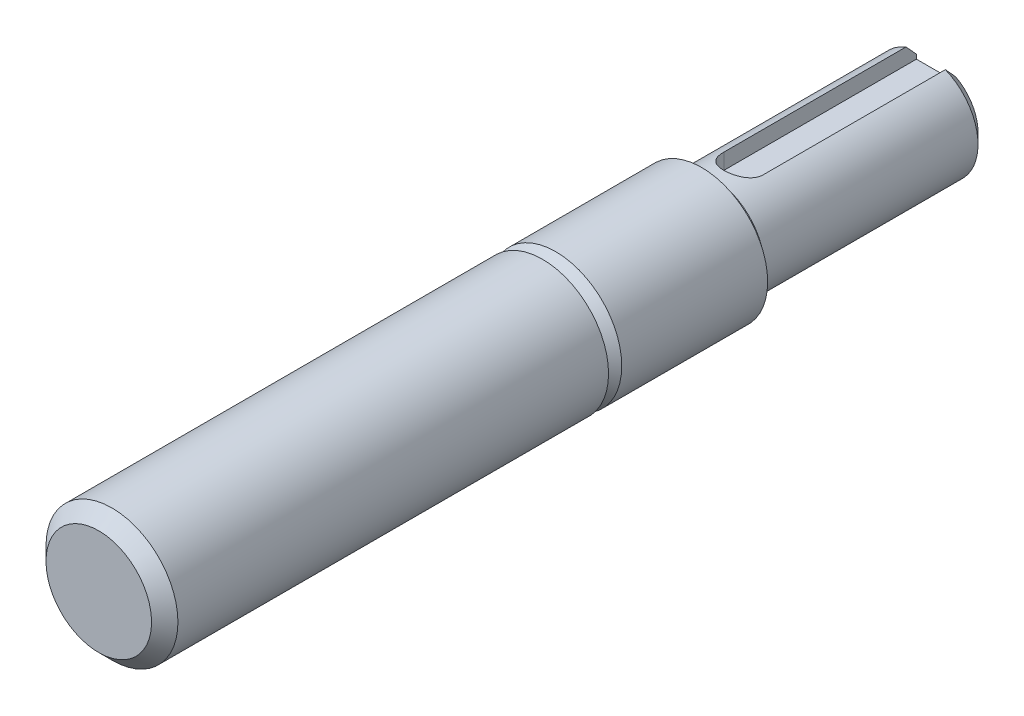
ISO-10303-21;
HEADER;
FILE_DESCRIPTION(('STEP AP214'),'2;1');
FILE_NAME('part.step','',(''),(''),'','','');
FILE_SCHEMA(('AUTOMOTIVE_DESIGN { 1 0 10303 214 1 1 1 1 }'));
ENDSEC;
DATA;
#1=APPLICATION_CONTEXT('core data for automotive mechanical design processes');
#2=APPLICATION_PROTOCOL_DEFINITION('international standard','automotive_design',2000,#1);
#3=PRODUCT_CONTEXT('',#1,'mechanical');
#4=PRODUCT('Part','Part','',(#3));
#5=PRODUCT_RELATED_PRODUCT_CATEGORY('part','',(#4));
#6=PRODUCT_DEFINITION_FORMATION('','',#4);
#7=PRODUCT_DEFINITION_CONTEXT('part definition',#1,'design');
#8=PRODUCT_DEFINITION('design','',#6,#7);
#9=PRODUCT_DEFINITION_SHAPE('','',#8);
#10=(LENGTH_UNIT() NAMED_UNIT(*) SI_UNIT(.MILLI.,.METRE.));
#11=(NAMED_UNIT(*) PLANE_ANGLE_UNIT() SI_UNIT($,.RADIAN.));
#12=(NAMED_UNIT(*) SI_UNIT($,.STERADIAN.) SOLID_ANGLE_UNIT());
#13=UNCERTAINTY_MEASURE_WITH_UNIT(LENGTH_MEASURE(1.E-05),#10,'distance_accuracy_value','');
#14=(GEOMETRIC_REPRESENTATION_CONTEXT(3) GLOBAL_UNCERTAINTY_ASSIGNED_CONTEXT((#13)) GLOBAL_UNIT_ASSIGNED_CONTEXT((#10,
#11,#12)) REPRESENTATION_CONTEXT('',''));
#15=CARTESIAN_POINT('',(0.,0.,0.));
#16=DIRECTION('',(0.,0.,1.));
#17=DIRECTION('',(1.,0.,0.));
#18=AXIS2_PLACEMENT_3D('',#15,#16,#17);
#19=CARTESIAN_POINT('',(0.,1.9812,-39.116));
#20=DIRECTION('',(0.,1.,0.));
#21=DIRECTION('',(0.,0.,1.));
#22=AXIS2_PLACEMENT_3D('',#19,#20,#21);
#23=PLANE('',#22);
#24=CARTESIAN_POINT('',(0.,1.9812,-39.116));
#25=DIRECTION('',(0.,1.,0.));
#26=DIRECTION('',(0.,0.,1.));
#27=AXIS2_PLACEMENT_3D('',#24,#25,#26);
#28=CIRCLE('',#27,1.19380000000001);
#29=CARTESIAN_POINT('',(-1.19380000000001,1.9812,-39.116));
#30=VERTEX_POINT('',#29);
#31=CARTESIAN_POINT('',(1.19380000000001,1.9812,-39.116));
#32=VERTEX_POINT('',#31);
#33=EDGE_CURVE('E75',#30,#32,#28,.T.);
#34=ORIENTED_EDGE('',*,*,#33,.T.);
#35=DIRECTION('',(0.,0.,-1.));
#36=VECTOR('',#35,1.);
#37=CARTESIAN_POINT('',(1.19380000000001,1.9812,-39.116));
#38=LINE('',#37,#36);
#39=CARTESIAN_POINT('',(1.19380000000001,1.9812,-50.8));
#40=VERTEX_POINT('',#39);
#41=EDGE_CURVE('E71',#32,#40,#38,.T.);
#42=ORIENTED_EDGE('',*,*,#41,.T.);
#43=DIRECTION('',(1.,0.,0.));
#44=VECTOR('',#43,1.);
#45=CARTESIAN_POINT('',(0.,1.9812,-50.8));
#46=LINE('',#45,#44);
#47=CARTESIAN_POINT('',(-1.19380000000001,1.9812,-50.8));
#48=VERTEX_POINT('',#47);
#49=EDGE_CURVE('E73',#40,#48,#46,.F.);
#50=ORIENTED_EDGE('',*,*,#49,.T.);
#51=DIRECTION('',(0.,0.,1.));
#52=VECTOR('',#51,1.);
#53=CARTESIAN_POINT('',(-1.19380000000001,1.9812,-50.8));
#54=LINE('',#53,#52);
#55=EDGE_CURVE('E98',#48,#30,#54,.T.);
#56=ORIENTED_EDGE('',*,*,#55,.T.);
#57=EDGE_LOOP('',(#34,#42,#50,#56));
#58=FACE_BOUND('',#57,.T.);
#59=ADVANCED_FACE('F17',(#58),#23,.T.);
#60=CARTESIAN_POINT('',(0.,2.54,-50.8));
#61=DIRECTION('',(0.,0.,1.));
#62=DIRECTION('',(1.,0.,0.));
#63=AXIS2_PLACEMENT_3D('',#60,#61,#62);
#64=PLANE('',#63);
#65=DIRECTION('',(0.,1.,0.));
#66=VECTOR('',#65,1.);
#67=CARTESIAN_POINT('',(1.19380000000001,1.9812,-50.8));
#68=LINE('',#67,#66);
#69=CARTESIAN_POINT('',(1.19380000000001,2.24197269385799,-50.7999999999905));
#70=VERTEX_POINT('',#69);
#71=EDGE_CURVE('E80',#40,#70,#68,.T.);
#72=ORIENTED_EDGE('',*,*,#71,.T.);
#73=CARTESIAN_POINT('',(0.,0.,-50.7999999999811));
#74=DIRECTION('',(0.,0.,1.));
#75=DIRECTION('',(0.,-1.,0.));
#76=AXIS2_PLACEMENT_3D('',#73,#74,#75);
#77=CIRCLE('',#76,2.54000000001042);
#78=CARTESIAN_POINT('',(-1.19380000000001,2.24197269386215,-50.7999999999869));
#79=VERTEX_POINT('',#78);
#80=EDGE_CURVE('E65',#79,#70,#77,.T.);
#81=ORIENTED_EDGE('',*,*,#80,.F.);
#82=DIRECTION('',(0.,1.,0.));
#83=VECTOR('',#82,1.);
#84=CARTESIAN_POINT('',(-1.19380000000001,1.9812,-50.8));
#85=LINE('',#84,#83);
#86=EDGE_CURVE('E86',#79,#48,#85,.F.);
#87=ORIENTED_EDGE('',*,*,#86,.T.);
#88=ORIENTED_EDGE('',*,*,#49,.F.);
#89=EDGE_LOOP('',(#72,#81,#87,#88));
#90=FACE_BOUND('',#89,.T.);
#91=ADVANCED_FACE('F83',(#90),#64,.F.);
#92=CARTESIAN_POINT('',(1.19380000000001,1.9812,-39.116));
#93=DIRECTION('',(1.,0.,0.));
#94=DIRECTION('',(0.,0.,-1.));
#95=AXIS2_PLACEMENT_3D('',#92,#93,#94);
#96=PLANE('',#95);
#97=ORIENTED_EDGE('',*,*,#71,.F.);
#98=ORIENTED_EDGE('',*,*,#41,.F.);
#99=DIRECTION('',(0.,1.,0.));
#100=VECTOR('',#99,1.);
#101=CARTESIAN_POINT('',(1.19380000000001,1.9812,-39.116));
#102=LINE('',#101,#100);
#103=CARTESIAN_POINT('',(1.1938,2.94201743026788,-39.116));
#104=VERTEX_POINT('',#103);
#105=EDGE_CURVE('E92',#32,#104,#102,.T.);
#106=ORIENTED_EDGE('',*,*,#105,.T.);
#107=DIRECTION('',(0.,0.,1.));
#108=VECTOR('',#107,1.);
#109=CARTESIAN_POINT('',(1.19379999999999,2.94201743026788,0.));
#110=LINE('',#109,#108);
#111=CARTESIAN_POINT('',(1.1938,2.94201743026577,-50.1649999999977));
#112=VERTEX_POINT('',#111);
#113=EDGE_CURVE('E131',#112,#104,#110,.T.);
#114=ORIENTED_EDGE('',*,*,#113,.F.);
#115=CARTESIAN_POINT('',(1.19380000000001,2.24197269385559,-50.7999999999927));
#116=CARTESIAN_POINT('',(1.19380000000001,2.30102184773771,-50.7478727474391));
#117=CARTESIAN_POINT('',(1.19380000000001,2.35985132104959,-50.69549787316));
#118=CARTESIAN_POINT('',(1.19380000000001,2.47713422347973,-50.5903327827947));
#119=CARTESIAN_POINT('',(1.19380000000001,2.53558766595209,-50.5375425816077));
#120=CARTESIAN_POINT('',(1.19380000000001,2.65218538347845,-50.4316235937607));
#121=CARTESIAN_POINT('',(1.19380000000001,2.71032966196324,-50.3784948108723));
#122=CARTESIAN_POINT('',(1.19380000000001,2.82635784116005,-50.2719494622469));
#123=CARTESIAN_POINT('',(1.19380000000001,2.88424173252965,-50.2185328863328));
#124=CARTESIAN_POINT('',(1.19380000000001,2.94201743026367,-50.1649999999954));
#125=B_SPLINE_CURVE_WITH_KNOTS('',3,(#115,#116,#117,#118,#119,#120,#121,#122,#123,#124),
.UNSPECIFIED.,.F.,.F.,(4,2,2,2,4),(0.,0.236295571088805,0.472582703695561,0.708867208729262,
0.945160124852192),.UNSPECIFIED.);
#126=EDGE_CURVE('E20',#70,#112,#125,.T.);
#127=ORIENTED_EDGE('',*,*,#126,.F.);
#128=EDGE_LOOP('',(#97,#98,#106,#114,#127));
#129=FACE_BOUND('',#128,.T.);
#130=ADVANCED_FACE('F89',(#129),#96,.F.);
#131=CARTESIAN_POINT('',(0.,1.9812,-39.116));
#132=DIRECTION('',(0.,1.,0.));
#133=DIRECTION('',(0.,0.,1.));
#134=AXIS2_PLACEMENT_3D('',#131,#132,#133);
#135=CYLINDRICAL_SURFACE('',#134,1.19380000000001);
#136=ORIENTED_EDGE('',*,*,#33,.F.);
#137=DIRECTION('',(0.,1.,0.));
#138=VECTOR('',#137,1.);
#139=CARTESIAN_POINT('',(-1.19380000000001,1.9812,-39.116));
#140=LINE('',#139,#138);
#141=CARTESIAN_POINT('',(-1.19380000000001,2.94201743026787,-39.116));
#142=VERTEX_POINT('',#141);
#143=EDGE_CURVE('E40',#30,#142,#140,.T.);
#144=ORIENTED_EDGE('',*,*,#143,.T.);
#145=CARTESIAN_POINT('',(1.19380000000001,2.94201743026787,-39.116));
#146=CARTESIAN_POINT('',(1.19380119866681,2.94201358886016,-39.0837006794339));
#147=CARTESIAN_POINT('',(1.19248832274411,2.94255000472484,-39.0514181860547));
#148=CARTESIAN_POINT('',(1.18726004777156,2.94466476095056,-38.9871097153263));
#149=CARTESIAN_POINT('',(1.18334552701422,2.94624274968451,-38.955083655099));
#150=CARTESIAN_POINT('',(1.16778270495955,2.95246335059753,-38.8599733658816));
#151=CARTESIAN_POINT('',(1.15231460697322,2.95859328345991,-38.7975669873183));
#152=CARTESIAN_POINT('',(1.11178752058578,2.97405718396478,-38.6764915213747));
#153=CARTESIAN_POINT('',(1.08673654710446,2.98338847338763,-38.6178193584763));
#154=CARTESIAN_POINT('',(1.02781996154741,3.00419457553498,-38.5054495950299));
#155=CARTESIAN_POINT('',(0.993947310826063,3.01567109782596,-38.4517560133961));
#156=CARTESIAN_POINT('',(0.916556207241775,3.04010954434601,-38.3482459870198));
#157=CARTESIAN_POINT('',(0.872671556205366,3.05311512160913,-38.2987137068106));
#158=CARTESIAN_POINT('',(0.777268767976151,3.07878482333539,-38.2075022142624));
#159=CARTESIAN_POINT('',(0.725747937264901,3.09144882544369,-38.1658257847587));
#160=CARTESIAN_POINT('',(0.6143515026055,3.11553409970194,-38.0901245060353));
#161=CARTESIAN_POINT('',(0.554248365904535,3.12689715223569,-38.0564145947422));
#162=CARTESIAN_POINT('',(0.428755311996273,3.14655515237975,-37.9997321113863));
#163=CARTESIAN_POINT('',(0.363372090039045,3.15485391337642,-37.9767461843048));
#164=CARTESIAN_POINT('',(0.248113919559845,3.16566292006336,-37.9472046793581));
#165=CARTESIAN_POINT('',(0.199029981495505,3.1691437195283,-37.9378494767225));
#166=CARTESIAN_POINT('',(0.0999697368556447,3.17381293873971,-37.9253464096887));
#167=CARTESIAN_POINT('',(0.0499935098316278,3.175001561824,-37.9221979946888));
#168=CARTESIAN_POINT('',(-0.0645836126415482,3.17499798237338,-37.9222025905412));
#169=CARTESIAN_POINT('',(-0.129196067703951,3.17300972415623,-37.9274627613588));
#170=CARTESIAN_POINT('',(-0.256527554722542,3.16526427616921,-37.9483006085164));
#171=CARTESIAN_POINT('',(-0.319245052887508,3.15950411459594,-37.9638864203256));
#172=CARTESIAN_POINT('',(-0.440872116174805,3.14483739738043,-38.0047409480993));
#173=CARTESIAN_POINT('',(-0.49979020110212,3.135938193104,-38.0299870521123));
#174=CARTESIAN_POINT('',(-0.612540299690452,3.11587921133503,-38.0893476602135));
#175=CARTESIAN_POINT('',(-0.666371662363197,3.10471914507505,-38.1234632973162));
#176=CARTESIAN_POINT('',(-0.769730700845348,3.08075692073994,-38.2011170498578));
#177=CARTESIAN_POINT('',(-0.819012913250933,3.06790808599841,-38.2449673466599));
#178=CARTESIAN_POINT('',(-0.909725244508853,3.04224448099814,-38.3401877476378));
#179=CARTESIAN_POINT('',(-0.951152407159723,3.02942972534667,-38.3915606700694));
#180=CARTESIAN_POINT('',(-1.02655136130083,3.00473884965422,-38.5027816716127));
#181=CARTESIAN_POINT('',(-1.06017236896745,2.99291828643937,-38.5628808896544));
#182=CARTESIAN_POINT('',(-1.11669659174165,2.97229264990151,-38.6883666895999));
#183=CARTESIAN_POINT('',(-1.13961269630879,2.96348395352317,-38.7537468010455));
#184=CARTESIAN_POINT('',(-1.16897915366354,2.95199794769408,-38.8688091509099));
#185=CARTESIAN_POINT('',(-1.17825632196959,2.9482901704303,-38.9176833288506));
#186=CARTESIAN_POINT('',(-1.19067896582103,2.94328394485073,-39.0163579822044));
#187=CARTESIAN_POINT('',(-1.19382013270198,2.9419871895713,-39.0661590837433));
#188=CARTESIAN_POINT('',(-1.19380000000001,2.94201743026787,-39.116));
#189=B_SPLINE_CURVE_WITH_KNOTS('',3,(#145,#146,#147,#148,#149,#150,#151,#152,#153,#154,#155,
#156,#157,#158,#159,#160,#161,#162,#163,#164,#165,#166,#167,#168,#169,#170,#171,#172,#173,#174,
#175,#176,#177,#178,#179,#180,#181,#182,#183,#184,#185,#186,#187,#188),.UNSPECIFIED.,.F.,.F.,(4,
2,2,2,2,2,2,2,2,2,2,2,2,2,2,2,2,2,2,2,2,4),(0.,0.0968341725826232,0.193635671390047,
0.386380325113608,0.57896412240193,0.771702051855779,0.973134503540126,1.17463817656653,
1.383119611818,1.59134071893434,1.74118814916205,1.89102228588731,2.08458400778532,
2.2782984166848,2.47156214275157,2.66485056890994,2.86558014013226,3.06638510544821,
3.27496528909712,3.48329367597682,3.63252530028045,3.7818616765455),.UNSPECIFIED.);
#190=EDGE_CURVE('E122',#104,#142,#189,.T.);
#191=ORIENTED_EDGE('',*,*,#190,.F.);
#192=ORIENTED_EDGE('',*,*,#105,.F.);
#193=EDGE_LOOP('',(#136,#144,#191,#192));
#194=FACE_BOUND('',#193,.T.);
#195=ADVANCED_FACE('F133',(#194),#135,.F.);
#196=CARTESIAN_POINT('',(-1.19380000000001,1.9812,-50.8));
#197=DIRECTION('',(-1.,0.,0.));
#198=DIRECTION('',(0.,0.,1.));
#199=AXIS2_PLACEMENT_3D('',#196,#197,#198);
#200=PLANE('',#199);
#201=ORIENTED_EDGE('',*,*,#55,.F.);
#202=ORIENTED_EDGE('',*,*,#86,.F.);
#203=CARTESIAN_POINT('',(-1.19380000000001,2.94201743026367,-50.1649999999954));
#204=CARTESIAN_POINT('',(-1.19380000000001,2.88424173252965,-50.2185328863328));
#205=CARTESIAN_POINT('',(-1.19380000000001,2.82635784116006,-50.2719494622469));
#206=CARTESIAN_POINT('',(-1.19380000000001,2.71032966196325,-50.3784948108723));
#207=CARTESIAN_POINT('',(-1.19380000000001,2.65218538347846,-50.4316235937607));
#208=CARTESIAN_POINT('',(-1.19380000000001,2.5355876659521,-50.5375425816077));
#209=CARTESIAN_POINT('',(-1.19380000000001,2.47713422347974,-50.5903327827947));
#210=CARTESIAN_POINT('',(-1.19380000000001,2.3598513210496,-50.69549787316));
#211=CARTESIAN_POINT('',(-1.19380000000001,2.30102184773772,-50.7478727474391));
#212=CARTESIAN_POINT('',(-1.19380000000001,2.24197269385561,-50.7999999999927));
#213=B_SPLINE_CURVE_WITH_KNOTS('',3,(#203,#204,#205,#206,#207,#208,#209,#210,#211,#212),
.UNSPECIFIED.,.F.,.F.,(4,2,2,2,4),(0.,0.236292916122926,0.472577421156633,0.708864553763386,
0.945160124852199),.UNSPECIFIED.);
#214=CARTESIAN_POINT('',(-1.19380000000001,2.94201743026577,-50.1649999999977));
#215=VERTEX_POINT('',#214);
#216=EDGE_CURVE('E149',#215,#79,#213,.T.);
#217=ORIENTED_EDGE('',*,*,#216,.F.);
#218=DIRECTION('',(0.,0.,1.));
#219=VECTOR('',#218,1.);
#220=CARTESIAN_POINT('',(-1.19380000000001,2.94201743026787,0.));
#221=LINE('',#220,#219);
#222=EDGE_CURVE('E130',#142,#215,#221,.F.);
#223=ORIENTED_EDGE('',*,*,#222,.F.);
#224=ORIENTED_EDGE('',*,*,#143,.F.);
#225=EDGE_LOOP('',(#201,#202,#217,#223,#224));
#226=FACE_BOUND('',#225,.T.);
#227=ADVANCED_FACE('F146',(#226),#200,.F.);
#228=CARTESIAN_POINT('',(0.,0.,-50.1649999999927));
#229=DIRECTION('',(0.,0.,1.));
#230=DIRECTION('',(0.,-1.,0.));
#231=AXIS2_PLACEMENT_3D('',#228,#229,#230);
#232=CONICAL_SURFACE('',#231,3.17499999999882,0.785398163397448);
#233=ORIENTED_EDGE('',*,*,#80,.T.);
#234=ORIENTED_EDGE('',*,*,#126,.T.);
#235=CARTESIAN_POINT('',(0.,0.,-50.165));
#236=DIRECTION('',(0.,0.,1.));
#237=DIRECTION('',(1.,0.,0.));
#238=AXIS2_PLACEMENT_3D('',#235,#236,#237);
#239=CIRCLE('',#238,3.175);
#240=EDGE_CURVE('E156',#215,#112,#239,.T.);
#241=ORIENTED_EDGE('',*,*,#240,.F.);
#242=ORIENTED_EDGE('',*,*,#216,.T.);
#243=EDGE_LOOP('',(#233,#234,#241,#242));
#244=FACE_BOUND('',#243,.T.);
#245=ADVANCED_FACE('F141',(#244),#232,.T.);
#246=CARTESIAN_POINT('',(0.,0.,0.));
#247=DIRECTION('',(0.,0.,1.));
#248=DIRECTION('',(1.,0.,0.));
#249=AXIS2_PLACEMENT_3D('',#246,#247,#248);
#250=CYLINDRICAL_SURFACE('',#249,3.175);
#251=ORIENTED_EDGE('',*,*,#222,.T.);
#252=ORIENTED_EDGE('',*,*,#240,.T.);
#253=ORIENTED_EDGE('',*,*,#113,.T.);
#254=ORIENTED_EDGE('',*,*,#190,.T.);
#255=EDGE_LOOP('',(#251,#252,#253,#254));
#256=FACE_BOUND('',#255,.T.);
#257=CARTESIAN_POINT('',(0.,0.,-37.2109999999566));
#258=DIRECTION('',(0.,0.,-1.));
#259=DIRECTION('',(-1.,0.,0.));
#260=AXIS2_PLACEMENT_3D('',#257,#258,#259);
#261=CIRCLE('',#260,3.1749999999704);
#262=CARTESIAN_POINT('',(-3.1749999999704,0.,-37.2109999999566));
#263=VERTEX_POINT('',#262);
#264=EDGE_CURVE('E121',#263,#263,#261,.F.);
#265=ORIENTED_EDGE('',*,*,#264,.F.);
#266=EDGE_LOOP('',(#265));
#267=FACE_BOUND('',#266,.T.);
#268=ADVANCED_FACE('F136',(#256,#267),#250,.T.);
#269=CARTESIAN_POINT('',(0.,0.,-37.2109999999566));
#270=DIRECTION('',(0.,0.,-1.));
#271=DIRECTION('',(-1.,0.,0.));
#272=AXIS2_PLACEMENT_3D('',#269,#270,#271);
#273=CONICAL_SURFACE('',#272,3.1749999999704,0.463647609000806);
#274=CARTESIAN_POINT('',(0.,0.,-36.5759999999682));
#275=DIRECTION('',(0.,0.,-1.));
#276=DIRECTION('',(-1.,0.,0.));
#277=AXIS2_PLACEMENT_3D('',#274,#275,#276);
#278=CIRCLE('',#277,2.8574999999762);
#279=CARTESIAN_POINT('',(-2.8574999999762,0.,-36.5759999999682));
#280=VERTEX_POINT('',#279);
#281=EDGE_CURVE('E118',#280,#280,#278,.T.);
#282=ORIENTED_EDGE('',*,*,#281,.T.);
#283=EDGE_LOOP('',(#282));
#284=FACE_BOUND('',#283,.T.);
#285=ORIENTED_EDGE('',*,*,#264,.T.);
#286=EDGE_LOOP('',(#285));
#287=FACE_BOUND('',#286,.T.);
#288=ADVANCED_FACE('F140',(#284,#287),#273,.T.);
#289=CARTESIAN_POINT('',(0.,4.00177,-36.576));
#290=DIRECTION('',(0.,0.,1.));
#291=DIRECTION('',(1.,0.,0.));
#292=AXIS2_PLACEMENT_3D('',#289,#290,#291);
#293=PLANE('',#292);
#294=ORIENTED_EDGE('',*,*,#281,.F.);
#295=EDGE_LOOP('',(#294));
#296=FACE_BOUND('',#295,.T.);
#297=CARTESIAN_POINT('',(0.,0.,-36.576));
#298=DIRECTION('',(0.,0.,1.));
#299=DIRECTION('',(1.,0.,0.));
#300=AXIS2_PLACEMENT_3D('',#297,#298,#299);
#301=CIRCLE('',#300,4.00177);
#302=CARTESIAN_POINT('',(4.00177,0.,-36.576));
#303=VERTEX_POINT('',#302);
#304=EDGE_CURVE('E115',#303,#303,#301,.T.);
#305=ORIENTED_EDGE('',*,*,#304,.F.);
#306=EDGE_LOOP('',(#305));
#307=FACE_BOUND('',#306,.T.);
#308=ADVANCED_FACE('F201',(#296,#307),#293,.F.);
#309=CARTESIAN_POINT('',(0.,0.,0.));
#310=DIRECTION('',(0.,0.,1.));
#311=DIRECTION('',(1.,0.,0.));
#312=AXIS2_PLACEMENT_3D('',#309,#310,#311);
#313=CYLINDRICAL_SURFACE('',#312,4.00177);
#314=ORIENTED_EDGE('',*,*,#304,.T.);
#315=EDGE_LOOP('',(#314));
#316=FACE_BOUND('',#315,.T.);
#317=CARTESIAN_POINT('',(0.,0.,-27.7243539999859));
#318=DIRECTION('',(0.,0.,-1.));
#319=DIRECTION('',(-1.,0.,0.));
#320=AXIS2_PLACEMENT_3D('',#317,#318,#319);
#321=CIRCLE('',#320,4.00176999994528);
#322=CARTESIAN_POINT('',(-4.00176999994528,0.,-27.7243539999859));
#323=VERTEX_POINT('',#322);
#324=EDGE_CURVE('E114',#323,#323,#321,.F.);
#325=ORIENTED_EDGE('',*,*,#324,.F.);
#326=EDGE_LOOP('',(#325));
#327=FACE_BOUND('',#326,.T.);
#328=ADVANCED_FACE('F198',(#316,#327),#313,.T.);
#329=CARTESIAN_POINT('',(0.,0.,-27.7243539999859));
#330=DIRECTION('',(0.,0.,-1.));
#331=DIRECTION('',(0.,1.,0.));
#332=AXIS2_PLACEMENT_3D('',#329,#330,#331);
#333=CONICAL_SURFACE('',#332,4.00176999994528,0.785398163397448);
#334=CARTESIAN_POINT('',(0.,0.,-26.9240000000082));
#335=DIRECTION('',(0.,0.,-1.));
#336=DIRECTION('',(0.,1.,0.));
#337=AXIS2_PLACEMENT_3D('',#334,#335,#336);
#338=CIRCLE('',#337,3.20141599996759);
#339=CARTESIAN_POINT('',(0.,3.20141599996759,-26.9240000000082));
#340=VERTEX_POINT('',#339);
#341=EDGE_CURVE('E111',#340,#340,#338,.T.);
#342=ORIENTED_EDGE('',*,*,#341,.T.);
#343=EDGE_LOOP('',(#342));
#344=FACE_BOUND('',#343,.T.);
#345=ORIENTED_EDGE('',*,*,#324,.T.);
#346=EDGE_LOOP('',(#345));
#347=FACE_BOUND('',#346,.T.);
#348=ADVANCED_FACE('F194',(#344,#347),#333,.T.);
#349=CARTESIAN_POINT('',(0.,0.,0.));
#350=DIRECTION('',(0.,0.,-1.));
#351=DIRECTION('',(-1.,0.,0.));
#352=AXIS2_PLACEMENT_3D('',#349,#350,#351);
#353=PLANE('',#352);
#354=CARTESIAN_POINT('',(0.,0.,0.));
#355=DIRECTION('',(0.,0.,-1.));
#356=DIRECTION('',(-1.,0.,0.));
#357=AXIS2_PLACEMENT_3D('',#354,#355,#356);
#358=CIRCLE('',#357,3.20141599996759);
#359=CARTESIAN_POINT('',(-3.20141599996759,0.,0.));
#360=VERTEX_POINT('',#359);
#361=EDGE_CURVE('E108',#360,#360,#358,.T.);
#362=ORIENTED_EDGE('',*,*,#361,.F.);
#363=EDGE_LOOP('',(#362));
#364=FACE_BOUND('',#363,.T.);
#365=ADVANCED_FACE('F190',(#364),#353,.F.);
#366=CARTESIAN_POINT('',(0.,4.00177,-26.924));
#367=DIRECTION('',(0.,0.,1.));
#368=DIRECTION('',(1.,0.,0.));
#369=AXIS2_PLACEMENT_3D('',#366,#367,#368);
#370=PLANE('',#369);
#371=ORIENTED_EDGE('',*,*,#341,.F.);
#372=EDGE_LOOP('',(#371));
#373=FACE_BOUND('',#372,.T.);
#374=CARTESIAN_POINT('',(0.,0.,-26.924));
#375=DIRECTION('',(0.,0.,1.));
#376=DIRECTION('',(1.,0.,0.));
#377=AXIS2_PLACEMENT_3D('',#374,#375,#376);
#378=CIRCLE('',#377,4.00177);
#379=CARTESIAN_POINT('',(4.00177,0.,-26.924));
#380=VERTEX_POINT('',#379);
#381=EDGE_CURVE('E31',#380,#380,#378,.T.);
#382=ORIENTED_EDGE('',*,*,#381,.F.);
#383=EDGE_LOOP('',(#382));
#384=FACE_BOUND('',#383,.T.);
#385=ADVANCED_FACE('F183',(#373,#384),#370,.F.);
#386=CARTESIAN_POINT('',(0.,0.,-0.800354000034531));
#387=DIRECTION('',(0.,0.,-1.));
#388=DIRECTION('',(-1.,0.,0.));
#389=AXIS2_PLACEMENT_3D('',#386,#387,#388);
#390=CONICAL_SURFACE('',#389,4.00177000000213,0.785398163397448);
#391=CARTESIAN_POINT('',(0.,0.,-0.800354));
#392=DIRECTION('',(0.,0.,1.));
#393=DIRECTION('',(1.,0.,0.));
#394=AXIS2_PLACEMENT_3D('',#391,#392,#393);
#395=CIRCLE('',#394,4.00177);
#396=CARTESIAN_POINT('',(4.00177,0.,-0.800354));
#397=VERTEX_POINT('',#396);
#398=EDGE_CURVE('E11',#397,#397,#395,.F.);
#399=ORIENTED_EDGE('',*,*,#398,.F.);
#400=EDGE_LOOP('',(#399));
#401=FACE_BOUND('',#400,.T.);
#402=ORIENTED_EDGE('',*,*,#361,.T.);
#403=EDGE_LOOP('',(#402));
#404=FACE_BOUND('',#403,.T.);
#405=ADVANCED_FACE('F177',(#401,#404),#390,.T.);
#406=CARTESIAN_POINT('',(0.,0.,0.));
#407=DIRECTION('',(0.,0.,1.));
#408=DIRECTION('',(1.,0.,0.));
#409=AXIS2_PLACEMENT_3D('',#406,#407,#408);
#410=CYLINDRICAL_SURFACE('',#409,4.00177);
#411=ORIENTED_EDGE('',*,*,#398,.T.);
#412=EDGE_LOOP('',(#411));
#413=FACE_BOUND('',#412,.T.);
#414=ORIENTED_EDGE('',*,*,#381,.T.);
#415=EDGE_LOOP('',(#414));
#416=FACE_BOUND('',#415,.T.);
#417=ADVANCED_FACE('F175',(#413,#416),#410,.T.);
#418=CLOSED_SHELL('',(#59,#91,#130,#195,#227,#245,#268,#288,#308,#328,#348,#365,#385,#405,#417));
#419=MANIFOLD_SOLID_BREP('B1',#418);
#420=ADVANCED_BREP_SHAPE_REPRESENTATION('',(#18,#419),#14);
#421=SHAPE_DEFINITION_REPRESENTATION(#9,#420);
ENDSEC;
END-ISO-10303-21;
